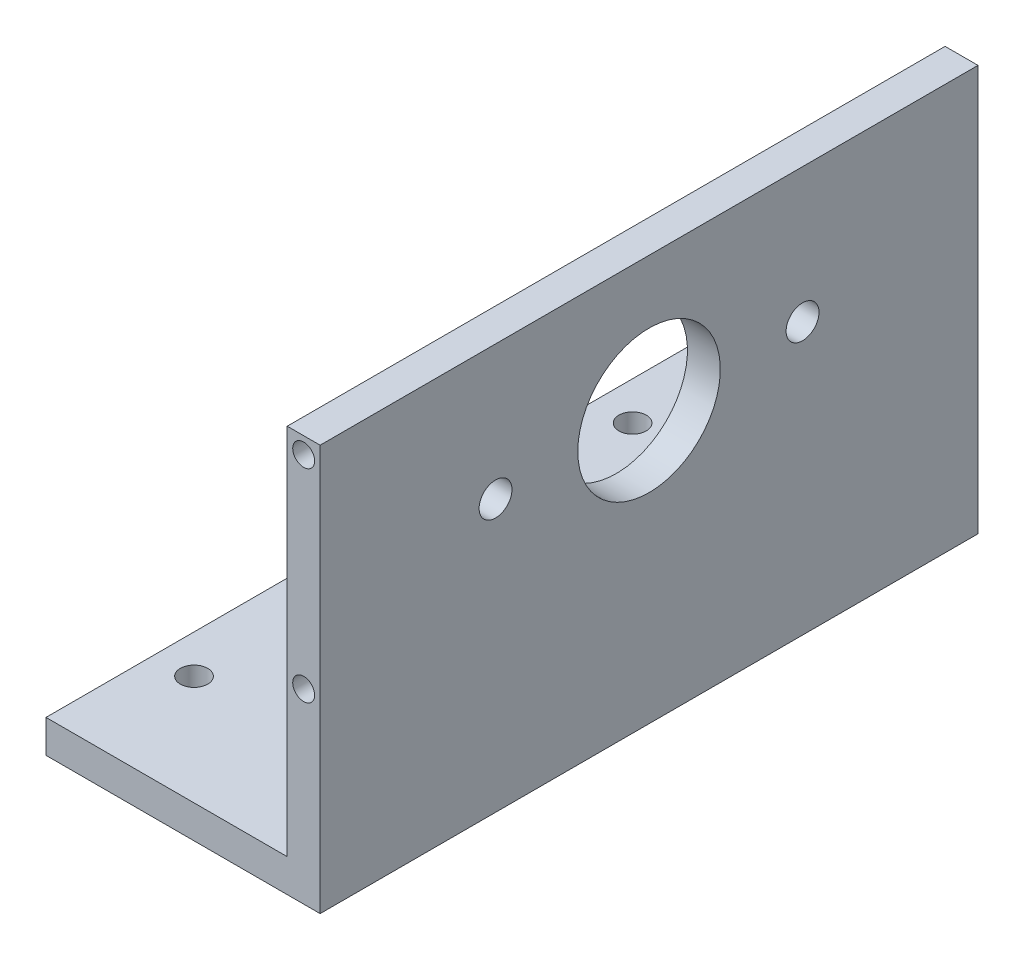
ISO-10303-21;
HEADER;
FILE_DESCRIPTION(('STEP AP214'),'2;1');
FILE_NAME('part.step','',(''),(''),'','','');
FILE_SCHEMA(('AUTOMOTIVE_DESIGN { 1 0 10303 214 1 1 1 1 }'));
ENDSEC;
DATA;
#1=APPLICATION_CONTEXT('core data for automotive mechanical design processes');
#2=APPLICATION_PROTOCOL_DEFINITION('international standard','automotive_design',2000,#1);
#3=PRODUCT_CONTEXT('',#1,'mechanical');
#4=PRODUCT('Part','Part','',(#3));
#5=PRODUCT_RELATED_PRODUCT_CATEGORY('part','',(#4));
#6=PRODUCT_DEFINITION_FORMATION('','',#4);
#7=PRODUCT_DEFINITION_CONTEXT('part definition',#1,'design');
#8=PRODUCT_DEFINITION('design','',#6,#7);
#9=PRODUCT_DEFINITION_SHAPE('','',#8);
#10=(LENGTH_UNIT() NAMED_UNIT(*) SI_UNIT(.MILLI.,.METRE.));
#11=(NAMED_UNIT(*) PLANE_ANGLE_UNIT() SI_UNIT($,.RADIAN.));
#12=(NAMED_UNIT(*) SI_UNIT($,.STERADIAN.) SOLID_ANGLE_UNIT());
#13=UNCERTAINTY_MEASURE_WITH_UNIT(LENGTH_MEASURE(1.E-05),#10,'distance_accuracy_value','');
#14=(GEOMETRIC_REPRESENTATION_CONTEXT(3) GLOBAL_UNCERTAINTY_ASSIGNED_CONTEXT((#13)) GLOBAL_UNIT_ASSIGNED_CONTEXT((#10,
#11,#12)) REPRESENTATION_CONTEXT('',''));
#15=CARTESIAN_POINT('',(0.,0.,0.));
#16=DIRECTION('',(0.,0.,1.));
#17=DIRECTION('',(1.,0.,0.));
#18=AXIS2_PLACEMENT_3D('',#15,#16,#17);
#19=CARTESIAN_POINT('',(0.,6.,60.));
#20=DIRECTION('',(0.,0.,-1.));
#21=DIRECTION('',(-1.,0.,0.));
#22=AXIS2_PLACEMENT_3D('',#19,#20,#21);
#23=PLANE('',#22);
#24=CARTESIAN_POINT('',(22.0000000000001,34.,60.));
#25=DIRECTION('',(0.,0.,-1.));
#26=DIRECTION('',(-1.,0.,0.));
#27=AXIS2_PLACEMENT_3D('',#24,#25,#26);
#28=CIRCLE('',#27,2.);
#29=CARTESIAN_POINT('',(20.0000000000001,34.,60.));
#30=VERTEX_POINT('',#29);
#31=EDGE_CURVE('E179',#30,#30,#28,.T.);
#32=ORIENTED_EDGE('',*,*,#31,.T.);
#33=EDGE_LOOP('',(#32));
#34=FACE_BOUND('',#33,.T.);
#35=DIRECTION('',(1.,0.,0.));
#36=VECTOR('',#35,1.);
#37=CARTESIAN_POINT('',(0.,0.,60.));
#38=LINE('',#37,#36);
#39=CARTESIAN_POINT('',(-25.,0.,60.));
#40=VERTEX_POINT('',#39);
#41=CARTESIAN_POINT('',(25.,0.,60.));
#42=VERTEX_POINT('',#41);
#43=EDGE_CURVE('E87',#40,#42,#38,.T.);
#44=ORIENTED_EDGE('',*,*,#43,.T.);
#45=DIRECTION('',(0.,-1.,0.));
#46=VECTOR('',#45,1.);
#47=CARTESIAN_POINT('',(25.,74.,60.));
#48=LINE('',#47,#46);
#49=CARTESIAN_POINT('',(25.,74.,60.));
#50=VERTEX_POINT('',#49);
#51=EDGE_CURVE('E107',#50,#42,#48,.T.);
#52=ORIENTED_EDGE('',*,*,#51,.F.);
#53=DIRECTION('',(1.,0.,0.));
#54=VECTOR('',#53,1.);
#55=CARTESIAN_POINT('',(0.,74.,60.));
#56=LINE('',#55,#54);
#57=CARTESIAN_POINT('',(19.,74.,60.));
#58=VERTEX_POINT('',#57);
#59=EDGE_CURVE('E129',#58,#50,#56,.T.);
#60=ORIENTED_EDGE('',*,*,#59,.F.);
#61=DIRECTION('',(0.,-1.,0.));
#62=VECTOR('',#61,1.);
#63=CARTESIAN_POINT('',(19.,74.,60.));
#64=LINE('',#63,#62);
#65=CARTESIAN_POINT('',(19.,6.00000000000001,60.));
#66=VERTEX_POINT('',#65);
#67=EDGE_CURVE('E102',#58,#66,#64,.T.);
#68=ORIENTED_EDGE('',*,*,#67,.T.);
#69=DIRECTION('',(1.,0.,0.));
#70=VECTOR('',#69,1.);
#71=CARTESIAN_POINT('',(0.,6.,60.));
#72=LINE('',#71,#70);
#73=CARTESIAN_POINT('',(-25.,6.,60.));
#74=VERTEX_POINT('',#73);
#75=EDGE_CURVE('E70',#74,#66,#72,.T.);
#76=ORIENTED_EDGE('',*,*,#75,.F.);
#77=DIRECTION('',(0.,-1.,0.));
#78=VECTOR('',#77,1.);
#79=CARTESIAN_POINT('',(-25.,6.,60.));
#80=LINE('',#79,#78);
#81=EDGE_CURVE('E47',#74,#40,#80,.T.);
#82=ORIENTED_EDGE('',*,*,#81,.T.);
#83=EDGE_LOOP('',(#44,#52,#60,#68,#76,#82));
#84=FACE_BOUND('',#83,.T.);
#85=CARTESIAN_POINT('',(22.0000000000001,71.,60.));
#86=DIRECTION('',(0.,0.,-1.));
#87=DIRECTION('',(-1.,0.,0.));
#88=AXIS2_PLACEMENT_3D('',#85,#86,#87);
#89=CIRCLE('',#88,2.);
#90=CARTESIAN_POINT('',(20.0000000000001,71.,60.));
#91=VERTEX_POINT('',#90);
#92=EDGE_CURVE('E185',#91,#91,#89,.T.);
#93=ORIENTED_EDGE('',*,*,#92,.T.);
#94=EDGE_LOOP('',(#93));
#95=FACE_BOUND('',#94,.T.);
#96=ADVANCED_FACE('F37',(#34,#84,#95),#23,.F.);
#97=CARTESIAN_POINT('',(0.,6.,-60.));
#98=DIRECTION('',(0.,0.,-1.));
#99=DIRECTION('',(-1.,0.,0.));
#100=AXIS2_PLACEMENT_3D('',#97,#98,#99);
#101=PLANE('',#100);
#102=CARTESIAN_POINT('',(22.0000000000001,71.,-60.));
#103=DIRECTION('',(0.,0.,-1.));
#104=DIRECTION('',(-1.,0.,0.));
#105=AXIS2_PLACEMENT_3D('',#102,#103,#104);
#106=CIRCLE('',#105,2.);
#107=CARTESIAN_POINT('',(20.0000000000001,71.,-60.));
#108=VERTEX_POINT('',#107);
#109=EDGE_CURVE('E173',#108,#108,#106,.T.);
#110=ORIENTED_EDGE('',*,*,#109,.F.);
#111=EDGE_LOOP('',(#110));
#112=FACE_BOUND('',#111,.T.);
#113=CARTESIAN_POINT('',(22.0000000000001,34.,-60.));
#114=DIRECTION('',(0.,0.,-1.));
#115=DIRECTION('',(-1.,0.,0.));
#116=AXIS2_PLACEMENT_3D('',#113,#114,#115);
#117=CIRCLE('',#116,2.);
#118=CARTESIAN_POINT('',(20.0000000000001,34.,-60.));
#119=VERTEX_POINT('',#118);
#120=EDGE_CURVE('E167',#119,#119,#117,.T.);
#121=ORIENTED_EDGE('',*,*,#120,.F.);
#122=EDGE_LOOP('',(#121));
#123=FACE_BOUND('',#122,.T.);
#124=DIRECTION('',(1.,0.,0.));
#125=VECTOR('',#124,1.);
#126=CARTESIAN_POINT('',(0.,0.,-60.));
#127=LINE('',#126,#125);
#128=CARTESIAN_POINT('',(-25.,0.,-60.));
#129=VERTEX_POINT('',#128);
#130=CARTESIAN_POINT('',(25.,0.,-60.));
#131=VERTEX_POINT('',#130);
#132=EDGE_CURVE('E101',#129,#131,#127,.T.);
#133=ORIENTED_EDGE('',*,*,#132,.F.);
#134=DIRECTION('',(0.,-1.,0.));
#135=VECTOR('',#134,1.);
#136=CARTESIAN_POINT('',(-25.,6.,-60.));
#137=LINE('',#136,#135);
#138=CARTESIAN_POINT('',(-25.,6.,-60.));
#139=VERTEX_POINT('',#138);
#140=EDGE_CURVE('E11',#139,#129,#137,.T.);
#141=ORIENTED_EDGE('',*,*,#140,.F.);
#142=DIRECTION('',(1.,0.,0.));
#143=VECTOR('',#142,1.);
#144=CARTESIAN_POINT('',(0.,6.,-60.));
#145=LINE('',#144,#143);
#146=CARTESIAN_POINT('',(19.,6.,-60.));
#147=VERTEX_POINT('',#146);
#148=EDGE_CURVE('E82',#139,#147,#145,.T.);
#149=ORIENTED_EDGE('',*,*,#148,.T.);
#150=DIRECTION('',(0.,-1.,0.));
#151=VECTOR('',#150,1.);
#152=CARTESIAN_POINT('',(19.,74.,-60.));
#153=LINE('',#152,#151);
#154=CARTESIAN_POINT('',(19.,74.,-60.));
#155=VERTEX_POINT('',#154);
#156=EDGE_CURVE('E93',#155,#147,#153,.T.);
#157=ORIENTED_EDGE('',*,*,#156,.F.);
#158=DIRECTION('',(1.,0.,0.));
#159=VECTOR('',#158,1.);
#160=CARTESIAN_POINT('',(0.,74.,-60.));
#161=LINE('',#160,#159);
#162=CARTESIAN_POINT('',(25.,74.,-60.));
#163=VERTEX_POINT('',#162);
#164=EDGE_CURVE('E126',#155,#163,#161,.T.);
#165=ORIENTED_EDGE('',*,*,#164,.T.);
#166=DIRECTION('',(0.,-1.,0.));
#167=VECTOR('',#166,1.);
#168=CARTESIAN_POINT('',(25.,74.,-60.));
#169=LINE('',#168,#167);
#170=EDGE_CURVE('E119',#163,#131,#169,.T.);
#171=ORIENTED_EDGE('',*,*,#170,.T.);
#172=EDGE_LOOP('',(#133,#141,#149,#157,#165,#171));
#173=FACE_BOUND('',#172,.T.);
#174=ADVANCED_FACE('F39',(#112,#123,#173),#101,.T.);
#175=CARTESIAN_POINT('',(-25.,6.,0.));
#176=DIRECTION('',(-1.,0.,0.));
#177=DIRECTION('',(0.,0.,1.));
#178=AXIS2_PLACEMENT_3D('',#175,#176,#177);
#179=PLANE('',#178);
#180=DIRECTION('',(0.,0.,-1.));
#181=VECTOR('',#180,1.);
#182=CARTESIAN_POINT('',(-25.,0.,0.));
#183=LINE('',#182,#181);
#184=EDGE_CURVE('E105',#40,#129,#183,.T.);
#185=ORIENTED_EDGE('',*,*,#184,.F.);
#186=ORIENTED_EDGE('',*,*,#81,.F.);
#187=DIRECTION('',(0.,0.,-1.));
#188=VECTOR('',#187,1.);
#189=CARTESIAN_POINT('',(-25.,6.,0.));
#190=LINE('',#189,#188);
#191=EDGE_CURVE('E95',#74,#139,#190,.T.);
#192=ORIENTED_EDGE('',*,*,#191,.T.);
#193=ORIENTED_EDGE('',*,*,#140,.T.);
#194=EDGE_LOOP('',(#185,#186,#192,#193));
#195=FACE_BOUND('',#194,.T.);
#196=ADVANCED_FACE('F208',(#195),#179,.T.);
#197=CARTESIAN_POINT('',(0.,6.,0.));
#198=DIRECTION('',(0.,1.,0.));
#199=DIRECTION('',(0.,0.,1.));
#200=AXIS2_PLACEMENT_3D('',#197,#198,#199);
#201=PLANE('',#200);
#202=CARTESIAN_POINT('',(12.,6.,40.));
#203=DIRECTION('',(0.,1.,0.));
#204=DIRECTION('',(0.,0.,1.));
#205=AXIS2_PLACEMENT_3D('',#202,#203,#204);
#206=CIRCLE('',#205,2.5);
#207=CARTESIAN_POINT('',(12.,6.,42.5));
#208=VERTEX_POINT('',#207);
#209=EDGE_CURVE('E163',#208,#208,#206,.T.);
#210=ORIENTED_EDGE('',*,*,#209,.F.);
#211=EDGE_LOOP('',(#210));
#212=FACE_BOUND('',#211,.T.);
#213=CARTESIAN_POINT('',(-18.,6.,40.));
#214=DIRECTION('',(0.,1.,0.));
#215=DIRECTION('',(0.,0.,1.));
#216=AXIS2_PLACEMENT_3D('',#213,#214,#215);
#217=CIRCLE('',#216,2.5);
#218=CARTESIAN_POINT('',(-18.,6.,42.5));
#219=VERTEX_POINT('',#218);
#220=EDGE_CURVE('E160',#219,#219,#217,.T.);
#221=ORIENTED_EDGE('',*,*,#220,.F.);
#222=EDGE_LOOP('',(#221));
#223=FACE_BOUND('',#222,.T.);
#224=CARTESIAN_POINT('',(12.,6.,-40.));
#225=DIRECTION('',(0.,1.,0.));
#226=DIRECTION('',(0.,0.,1.));
#227=AXIS2_PLACEMENT_3D('',#224,#225,#226);
#228=CIRCLE('',#227,2.5);
#229=CARTESIAN_POINT('',(12.,6.,-37.5));
#230=VERTEX_POINT('',#229);
#231=EDGE_CURVE('E156',#230,#230,#228,.T.);
#232=ORIENTED_EDGE('',*,*,#231,.F.);
#233=EDGE_LOOP('',(#232));
#234=FACE_BOUND('',#233,.T.);
#235=CARTESIAN_POINT('',(-18.,6.,-40.));
#236=DIRECTION('',(0.,1.,0.));
#237=DIRECTION('',(0.,0.,1.));
#238=AXIS2_PLACEMENT_3D('',#235,#236,#237);
#239=CIRCLE('',#238,2.5);
#240=CARTESIAN_POINT('',(-18.,6.,-37.5));
#241=VERTEX_POINT('',#240);
#242=EDGE_CURVE('E152',#241,#241,#239,.T.);
#243=ORIENTED_EDGE('',*,*,#242,.F.);
#244=EDGE_LOOP('',(#243));
#245=FACE_BOUND('',#244,.T.);
#246=DIRECTION('',(0.,0.,1.));
#247=VECTOR('',#246,1.);
#248=CARTESIAN_POINT('',(19.,6.,0.));
#249=LINE('',#248,#247);
#250=EDGE_CURVE('E79',#147,#66,#249,.T.);
#251=ORIENTED_EDGE('',*,*,#250,.F.);
#252=ORIENTED_EDGE('',*,*,#148,.F.);
#253=ORIENTED_EDGE('',*,*,#191,.F.);
#254=ORIENTED_EDGE('',*,*,#75,.T.);
#255=EDGE_LOOP('',(#251,#252,#253,#254));
#256=FACE_BOUND('',#255,.T.);
#257=ADVANCED_FACE('F81',(#212,#223,#234,#245,#256),#201,.T.);
#258=CARTESIAN_POINT('',(0.,0.,0.));
#259=DIRECTION('',(0.,1.,0.));
#260=DIRECTION('',(0.,0.,1.));
#261=AXIS2_PLACEMENT_3D('',#258,#259,#260);
#262=PLANE('',#261);
#263=CARTESIAN_POINT('',(12.,0.,40.));
#264=DIRECTION('',(0.,1.,0.));
#265=DIRECTION('',(0.,0.,1.));
#266=AXIS2_PLACEMENT_3D('',#263,#264,#265);
#267=CIRCLE('',#266,2.5);
#268=CARTESIAN_POINT('',(12.,0.,42.5));
#269=VERTEX_POINT('',#268);
#270=EDGE_CURVE('E41',#269,#269,#267,.T.);
#271=ORIENTED_EDGE('',*,*,#270,.T.);
#272=EDGE_LOOP('',(#271));
#273=FACE_BOUND('',#272,.T.);
#274=CARTESIAN_POINT('',(-18.,0.,40.));
#275=DIRECTION('',(0.,1.,0.));
#276=DIRECTION('',(0.,0.,1.));
#277=AXIS2_PLACEMENT_3D('',#274,#275,#276);
#278=CIRCLE('',#277,2.5);
#279=CARTESIAN_POINT('',(-18.,0.,42.5));
#280=VERTEX_POINT('',#279);
#281=EDGE_CURVE('E159',#280,#280,#278,.T.);
#282=ORIENTED_EDGE('',*,*,#281,.T.);
#283=EDGE_LOOP('',(#282));
#284=FACE_BOUND('',#283,.T.);
#285=CARTESIAN_POINT('',(12.,0.,-40.));
#286=DIRECTION('',(0.,1.,0.));
#287=DIRECTION('',(0.,0.,1.));
#288=AXIS2_PLACEMENT_3D('',#285,#286,#287);
#289=CIRCLE('',#288,2.5);
#290=CARTESIAN_POINT('',(12.,0.,-37.5));
#291=VERTEX_POINT('',#290);
#292=EDGE_CURVE('E155',#291,#291,#289,.T.);
#293=ORIENTED_EDGE('',*,*,#292,.T.);
#294=EDGE_LOOP('',(#293));
#295=FACE_BOUND('',#294,.T.);
#296=CARTESIAN_POINT('',(-18.,0.,-40.));
#297=DIRECTION('',(0.,1.,0.));
#298=DIRECTION('',(0.,0.,1.));
#299=AXIS2_PLACEMENT_3D('',#296,#297,#298);
#300=CIRCLE('',#299,2.5);
#301=CARTESIAN_POINT('',(-18.,0.,-37.5));
#302=VERTEX_POINT('',#301);
#303=EDGE_CURVE('E149',#302,#302,#300,.T.);
#304=ORIENTED_EDGE('',*,*,#303,.T.);
#305=EDGE_LOOP('',(#304));
#306=FACE_BOUND('',#305,.T.);
#307=ORIENTED_EDGE('',*,*,#132,.T.);
#308=DIRECTION('',(0.,0.,-1.));
#309=VECTOR('',#308,1.);
#310=CARTESIAN_POINT('',(25.,0.,0.));
#311=LINE('',#310,#309);
#312=EDGE_CURVE('E123',#42,#131,#311,.T.);
#313=ORIENTED_EDGE('',*,*,#312,.F.);
#314=ORIENTED_EDGE('',*,*,#43,.F.);
#315=ORIENTED_EDGE('',*,*,#184,.T.);
#316=EDGE_LOOP('',(#307,#313,#314,#315));
#317=FACE_BOUND('',#316,.T.);
#318=ADVANCED_FACE('F212',(#273,#284,#295,#306,#317),#262,.F.);
#319=CARTESIAN_POINT('',(19.,74.,0.));
#320=DIRECTION('',(1.,0.,0.));
#321=DIRECTION('',(0.,0.,-1.));
#322=AXIS2_PLACEMENT_3D('',#319,#320,#321);
#323=PLANE('',#322);
#324=CARTESIAN_POINT('',(19.,49.5,28.));
#325=DIRECTION('',(-1.,0.,0.));
#326=DIRECTION('',(0.,0.,-1.));
#327=AXIS2_PLACEMENT_3D('',#324,#325,#326);
#328=CIRCLE('',#327,3.);
#329=CARTESIAN_POINT('',(19.,49.5,25.));
#330=VERTEX_POINT('',#329);
#331=EDGE_CURVE('E146',#330,#330,#328,.T.);
#332=ORIENTED_EDGE('',*,*,#331,.F.);
#333=EDGE_LOOP('',(#332));
#334=FACE_BOUND('',#333,.T.);
#335=CARTESIAN_POINT('',(19.,49.5,-28.));
#336=DIRECTION('',(-1.,0.,0.));
#337=DIRECTION('',(0.,0.,1.));
#338=AXIS2_PLACEMENT_3D('',#335,#336,#337);
#339=CIRCLE('',#338,3.);
#340=CARTESIAN_POINT('',(19.,49.5,-25.));
#341=VERTEX_POINT('',#340);
#342=EDGE_CURVE('E140',#341,#341,#339,.T.);
#343=ORIENTED_EDGE('',*,*,#342,.F.);
#344=EDGE_LOOP('',(#343));
#345=FACE_BOUND('',#344,.T.);
#346=CARTESIAN_POINT('',(19.,49.5,0.));
#347=DIRECTION('',(-1.,0.,0.));
#348=DIRECTION('',(0.,0.,1.));
#349=AXIS2_PLACEMENT_3D('',#346,#347,#348);
#350=CIRCLE('',#349,13.);
#351=CARTESIAN_POINT('',(19.,49.5,13.));
#352=VERTEX_POINT('',#351);
#353=EDGE_CURVE('E134',#352,#352,#350,.T.);
#354=ORIENTED_EDGE('',*,*,#353,.F.);
#355=EDGE_LOOP('',(#354));
#356=FACE_BOUND('',#355,.T.);
#357=ORIENTED_EDGE('',*,*,#156,.T.);
#358=ORIENTED_EDGE('',*,*,#250,.T.);
#359=ORIENTED_EDGE('',*,*,#67,.F.);
#360=DIRECTION('',(0.,0.,1.));
#361=VECTOR('',#360,1.);
#362=CARTESIAN_POINT('',(19.,74.,0.));
#363=LINE('',#362,#361);
#364=EDGE_CURVE('E99',#155,#58,#363,.T.);
#365=ORIENTED_EDGE('',*,*,#364,.F.);
#366=EDGE_LOOP('',(#357,#358,#359,#365));
#367=FACE_BOUND('',#366,.T.);
#368=ADVANCED_FACE('F97',(#334,#345,#356,#367),#323,.F.);
#369=CARTESIAN_POINT('',(25.,74.,0.));
#370=DIRECTION('',(-1.,0.,0.));
#371=DIRECTION('',(0.,0.,1.));
#372=AXIS2_PLACEMENT_3D('',#369,#370,#371);
#373=PLANE('',#372);
#374=CARTESIAN_POINT('',(25.,49.5,28.));
#375=DIRECTION('',(-1.,0.,0.));
#376=DIRECTION('',(0.,0.,-1.));
#377=AXIS2_PLACEMENT_3D('',#374,#375,#376);
#378=CIRCLE('',#377,3.);
#379=CARTESIAN_POINT('',(25.,49.5,25.));
#380=VERTEX_POINT('',#379);
#381=EDGE_CURVE('E143',#380,#380,#378,.T.);
#382=ORIENTED_EDGE('',*,*,#381,.T.);
#383=EDGE_LOOP('',(#382));
#384=FACE_BOUND('',#383,.T.);
#385=CARTESIAN_POINT('',(25.,49.5,-28.));
#386=DIRECTION('',(-1.,0.,0.));
#387=DIRECTION('',(0.,0.,1.));
#388=AXIS2_PLACEMENT_3D('',#385,#386,#387);
#389=CIRCLE('',#388,3.);
#390=CARTESIAN_POINT('',(25.,49.5,-25.));
#391=VERTEX_POINT('',#390);
#392=EDGE_CURVE('E137',#391,#391,#389,.T.);
#393=ORIENTED_EDGE('',*,*,#392,.T.);
#394=EDGE_LOOP('',(#393));
#395=FACE_BOUND('',#394,.T.);
#396=CARTESIAN_POINT('',(25.,49.5,0.));
#397=DIRECTION('',(-1.,0.,0.));
#398=DIRECTION('',(0.,0.,1.));
#399=AXIS2_PLACEMENT_3D('',#396,#397,#398);
#400=CIRCLE('',#399,13.);
#401=CARTESIAN_POINT('',(25.,49.5,13.));
#402=VERTEX_POINT('',#401);
#403=EDGE_CURVE('E127',#402,#402,#400,.T.);
#404=ORIENTED_EDGE('',*,*,#403,.T.);
#405=EDGE_LOOP('',(#404));
#406=FACE_BOUND('',#405,.T.);
#407=ORIENTED_EDGE('',*,*,#312,.T.);
#408=ORIENTED_EDGE('',*,*,#170,.F.);
#409=DIRECTION('',(0.,0.,-1.));
#410=VECTOR('',#409,1.);
#411=CARTESIAN_POINT('',(25.,74.,0.));
#412=LINE('',#411,#410);
#413=EDGE_CURVE('E122',#50,#163,#412,.T.);
#414=ORIENTED_EDGE('',*,*,#413,.F.);
#415=ORIENTED_EDGE('',*,*,#51,.T.);
#416=EDGE_LOOP('',(#407,#408,#414,#415));
#417=FACE_BOUND('',#416,.T.);
#418=ADVANCED_FACE('F276',(#384,#395,#406,#417),#373,.F.);
#419=CARTESIAN_POINT('',(0.,74.,0.));
#420=DIRECTION('',(0.,1.,0.));
#421=DIRECTION('',(0.,0.,1.));
#422=AXIS2_PLACEMENT_3D('',#419,#420,#421);
#423=PLANE('',#422);
#424=ORIENTED_EDGE('',*,*,#164,.F.);
#425=ORIENTED_EDGE('',*,*,#364,.T.);
#426=ORIENTED_EDGE('',*,*,#59,.T.);
#427=ORIENTED_EDGE('',*,*,#413,.T.);
#428=EDGE_LOOP('',(#424,#425,#426,#427));
#429=FACE_BOUND('',#428,.T.);
#430=ADVANCED_FACE('F272',(#429),#423,.T.);
#431=CARTESIAN_POINT('',(25.,49.5,0.));
#432=DIRECTION('',(-1.,0.,0.));
#433=DIRECTION('',(0.,0.,1.));
#434=AXIS2_PLACEMENT_3D('',#431,#432,#433);
#435=CYLINDRICAL_SURFACE('',#434,13.);
#436=ORIENTED_EDGE('',*,*,#403,.F.);
#437=EDGE_LOOP('',(#436));
#438=FACE_BOUND('',#437,.T.);
#439=ORIENTED_EDGE('',*,*,#353,.T.);
#440=EDGE_LOOP('',(#439));
#441=FACE_BOUND('',#440,.T.);
#442=ADVANCED_FACE('F268',(#438,#441),#435,.F.);
#443=CARTESIAN_POINT('',(25.,49.5,-28.));
#444=DIRECTION('',(-1.,0.,0.));
#445=DIRECTION('',(0.,0.,1.));
#446=AXIS2_PLACEMENT_3D('',#443,#444,#445);
#447=CYLINDRICAL_SURFACE('',#446,3.);
#448=ORIENTED_EDGE('',*,*,#392,.F.);
#449=EDGE_LOOP('',(#448));
#450=FACE_BOUND('',#449,.T.);
#451=ORIENTED_EDGE('',*,*,#342,.T.);
#452=EDGE_LOOP('',(#451));
#453=FACE_BOUND('',#452,.T.);
#454=ADVANCED_FACE('F264',(#450,#453),#447,.F.);
#455=CARTESIAN_POINT('',(25.,49.5,28.));
#456=DIRECTION('',(-1.,0.,0.));
#457=DIRECTION('',(0.,0.,1.));
#458=AXIS2_PLACEMENT_3D('',#455,#456,#457);
#459=CYLINDRICAL_SURFACE('',#458,3.);
#460=ORIENTED_EDGE('',*,*,#381,.F.);
#461=EDGE_LOOP('',(#460));
#462=FACE_BOUND('',#461,.T.);
#463=ORIENTED_EDGE('',*,*,#331,.T.);
#464=EDGE_LOOP('',(#463));
#465=FACE_BOUND('',#464,.T.);
#466=ADVANCED_FACE('F260',(#462,#465),#459,.F.);
#467=CARTESIAN_POINT('',(-18.,-4.,-40.));
#468=DIRECTION('',(0.,1.,0.));
#469=DIRECTION('',(0.,0.,1.));
#470=AXIS2_PLACEMENT_3D('',#467,#468,#469);
#471=CYLINDRICAL_SURFACE('',#470,2.5);
#472=ORIENTED_EDGE('',*,*,#242,.T.);
#473=EDGE_LOOP('',(#472));
#474=FACE_BOUND('',#473,.T.);
#475=ORIENTED_EDGE('',*,*,#303,.F.);
#476=EDGE_LOOP('',(#475));
#477=FACE_BOUND('',#476,.T.);
#478=ADVANCED_FACE('F253',(#474,#477),#471,.F.);
#479=CARTESIAN_POINT('',(12.,-4.,-40.));
#480=DIRECTION('',(0.,1.,0.));
#481=DIRECTION('',(0.,0.,1.));
#482=AXIS2_PLACEMENT_3D('',#479,#480,#481);
#483=CYLINDRICAL_SURFACE('',#482,2.5);
#484=ORIENTED_EDGE('',*,*,#231,.T.);
#485=EDGE_LOOP('',(#484));
#486=FACE_BOUND('',#485,.T.);
#487=ORIENTED_EDGE('',*,*,#292,.F.);
#488=EDGE_LOOP('',(#487));
#489=FACE_BOUND('',#488,.T.);
#490=ADVANCED_FACE('F243',(#486,#489),#483,.F.);
#491=CARTESIAN_POINT('',(-18.,-4.,40.));
#492=DIRECTION('',(0.,1.,0.));
#493=DIRECTION('',(0.,0.,1.));
#494=AXIS2_PLACEMENT_3D('',#491,#492,#493);
#495=CYLINDRICAL_SURFACE('',#494,2.5);
#496=ORIENTED_EDGE('',*,*,#220,.T.);
#497=EDGE_LOOP('',(#496));
#498=FACE_BOUND('',#497,.T.);
#499=ORIENTED_EDGE('',*,*,#281,.F.);
#500=EDGE_LOOP('',(#499));
#501=FACE_BOUND('',#500,.T.);
#502=ADVANCED_FACE('F240',(#498,#501),#495,.F.);
#503=CARTESIAN_POINT('',(12.,-4.,40.));
#504=DIRECTION('',(0.,1.,0.));
#505=DIRECTION('',(0.,0.,1.));
#506=AXIS2_PLACEMENT_3D('',#503,#504,#505);
#507=CYLINDRICAL_SURFACE('',#506,2.5);
#508=ORIENTED_EDGE('',*,*,#209,.T.);
#509=EDGE_LOOP('',(#508));
#510=FACE_BOUND('',#509,.T.);
#511=ORIENTED_EDGE('',*,*,#270,.F.);
#512=EDGE_LOOP('',(#511));
#513=FACE_BOUND('',#512,.T.);
#514=ADVANCED_FACE('F242',(#510,#513),#507,.F.);
#515=CARTESIAN_POINT('',(22.0000000000001,34.,-40.));
#516=DIRECTION('',(0.,0.,-1.));
#517=DIRECTION('',(-1.,0.,0.));
#518=AXIS2_PLACEMENT_3D('',#515,#516,#517);
#519=CYLINDRICAL_SURFACE('',#518,2.);
#520=CARTESIAN_POINT('',(22.0000000000001,34.,-40.));
#521=DIRECTION('',(0.,0.,-1.));
#522=DIRECTION('',(-1.,0.,0.));
#523=AXIS2_PLACEMENT_3D('',#520,#521,#522);
#524=CIRCLE('',#523,2.);
#525=CARTESIAN_POINT('',(20.0000000000001,34.,-40.));
#526=VERTEX_POINT('',#525);
#527=EDGE_CURVE('E166',#526,#526,#524,.T.);
#528=ORIENTED_EDGE('',*,*,#527,.F.);
#529=EDGE_LOOP('',(#528));
#530=FACE_BOUND('',#529,.T.);
#531=ORIENTED_EDGE('',*,*,#120,.T.);
#532=EDGE_LOOP('',(#531));
#533=FACE_BOUND('',#532,.T.);
#534=ADVANCED_FACE('F250',(#530,#533),#519,.F.);
#535=CARTESIAN_POINT('',(22.0000000000001,34.,-40.));
#536=DIRECTION('',(0.,0.,-1.));
#537=DIRECTION('',(-1.,0.,0.));
#538=AXIS2_PLACEMENT_3D('',#535,#536,#537);
#539=PLANE('',#538);
#540=ORIENTED_EDGE('',*,*,#527,.T.);
#541=EDGE_LOOP('',(#540));
#542=FACE_BOUND('',#541,.T.);
#543=ADVANCED_FACE('F374',(#542),#539,.T.);
#544=CARTESIAN_POINT('',(22.0000000000001,71.,-40.));
#545=DIRECTION('',(0.,0.,-1.));
#546=DIRECTION('',(-1.,0.,0.));
#547=AXIS2_PLACEMENT_3D('',#544,#545,#546);
#548=CYLINDRICAL_SURFACE('',#547,2.);
#549=CARTESIAN_POINT('',(22.0000000000001,71.,-40.));
#550=DIRECTION('',(0.,0.,-1.));
#551=DIRECTION('',(-1.,0.,0.));
#552=AXIS2_PLACEMENT_3D('',#549,#550,#551);
#553=CIRCLE('',#552,2.);
#554=CARTESIAN_POINT('',(20.0000000000001,71.,-40.));
#555=VERTEX_POINT('',#554);
#556=EDGE_CURVE('E170',#555,#555,#553,.T.);
#557=ORIENTED_EDGE('',*,*,#556,.F.);
#558=EDGE_LOOP('',(#557));
#559=FACE_BOUND('',#558,.T.);
#560=ORIENTED_EDGE('',*,*,#109,.T.);
#561=EDGE_LOOP('',(#560));
#562=FACE_BOUND('',#561,.T.);
#563=ADVANCED_FACE('F383',(#559,#562),#548,.F.);
#564=CARTESIAN_POINT('',(22.0000000000001,71.,-40.));
#565=DIRECTION('',(0.,0.,-1.));
#566=DIRECTION('',(-1.,0.,0.));
#567=AXIS2_PLACEMENT_3D('',#564,#565,#566);
#568=PLANE('',#567);
#569=ORIENTED_EDGE('',*,*,#556,.T.);
#570=EDGE_LOOP('',(#569));
#571=FACE_BOUND('',#570,.T.);
#572=ADVANCED_FACE('F393',(#571),#568,.T.);
#573=CARTESIAN_POINT('',(22.0000000000001,34.,40.));
#574=DIRECTION('',(0.,0.,1.));
#575=DIRECTION('',(1.,0.,0.));
#576=AXIS2_PLACEMENT_3D('',#573,#574,#575);
#577=CYLINDRICAL_SURFACE('',#576,2.);
#578=CARTESIAN_POINT('',(22.0000000000001,34.,40.));
#579=DIRECTION('',(0.,0.,-1.));
#580=DIRECTION('',(-1.,0.,0.));
#581=AXIS2_PLACEMENT_3D('',#578,#579,#580);
#582=CIRCLE('',#581,2.);
#583=CARTESIAN_POINT('',(20.0000000000001,34.,40.));
#584=VERTEX_POINT('',#583);
#585=EDGE_CURVE('E176',#584,#584,#582,.T.);
#586=ORIENTED_EDGE('',*,*,#585,.T.);
#587=EDGE_LOOP('',(#586));
#588=FACE_BOUND('',#587,.T.);
#589=ORIENTED_EDGE('',*,*,#31,.F.);
#590=EDGE_LOOP('',(#589));
#591=FACE_BOUND('',#590,.T.);
#592=ADVANCED_FACE('F402',(#588,#591),#577,.F.);
#593=CARTESIAN_POINT('',(22.0000000000001,34.,40.));
#594=DIRECTION('',(0.,0.,1.));
#595=DIRECTION('',(-1.,0.,0.));
#596=AXIS2_PLACEMENT_3D('',#593,#594,#595);
#597=PLANE('',#596);
#598=ORIENTED_EDGE('',*,*,#585,.F.);
#599=EDGE_LOOP('',(#598));
#600=FACE_BOUND('',#599,.T.);
#601=ADVANCED_FACE('F200',(#600),#597,.T.);
#602=CARTESIAN_POINT('',(22.0000000000001,71.,40.));
#603=DIRECTION('',(0.,0.,1.));
#604=DIRECTION('',(1.,0.,0.));
#605=AXIS2_PLACEMENT_3D('',#602,#603,#604);
#606=CYLINDRICAL_SURFACE('',#605,2.);
#607=CARTESIAN_POINT('',(22.0000000000001,71.,40.));
#608=DIRECTION('',(0.,0.,-1.));
#609=DIRECTION('',(-1.,0.,0.));
#610=AXIS2_PLACEMENT_3D('',#607,#608,#609);
#611=CIRCLE('',#610,2.);
#612=CARTESIAN_POINT('',(20.0000000000001,71.,40.));
#613=VERTEX_POINT('',#612);
#614=EDGE_CURVE('E182',#613,#613,#611,.T.);
#615=ORIENTED_EDGE('',*,*,#614,.T.);
#616=EDGE_LOOP('',(#615));
#617=FACE_BOUND('',#616,.T.);
#618=ORIENTED_EDGE('',*,*,#92,.F.);
#619=EDGE_LOOP('',(#618));
#620=FACE_BOUND('',#619,.T.);
#621=ADVANCED_FACE('F191',(#617,#620),#606,.F.);
#622=CARTESIAN_POINT('',(22.0000000000001,71.,40.));
#623=DIRECTION('',(0.,0.,1.));
#624=DIRECTION('',(-1.,0.,0.));
#625=AXIS2_PLACEMENT_3D('',#622,#623,#624);
#626=PLANE('',#625);
#627=ORIENTED_EDGE('',*,*,#614,.F.);
#628=EDGE_LOOP('',(#627));
#629=FACE_BOUND('',#628,.T.);
#630=ADVANCED_FACE('F194',(#629),#626,.T.);
#631=CLOSED_SHELL('',(#96,#174,#196,#257,#318,#368,#418,#430,#442,#454,#466,#478,#490,#502,#514,
#534,#543,#563,#572,#592,#601,#621,#630));
#632=MANIFOLD_SOLID_BREP('B2',#631);
#633=ADVANCED_BREP_SHAPE_REPRESENTATION('',(#18,#632),#14);
#634=SHAPE_DEFINITION_REPRESENTATION(#9,#633);
ENDSEC;
END-ISO-10303-21;
